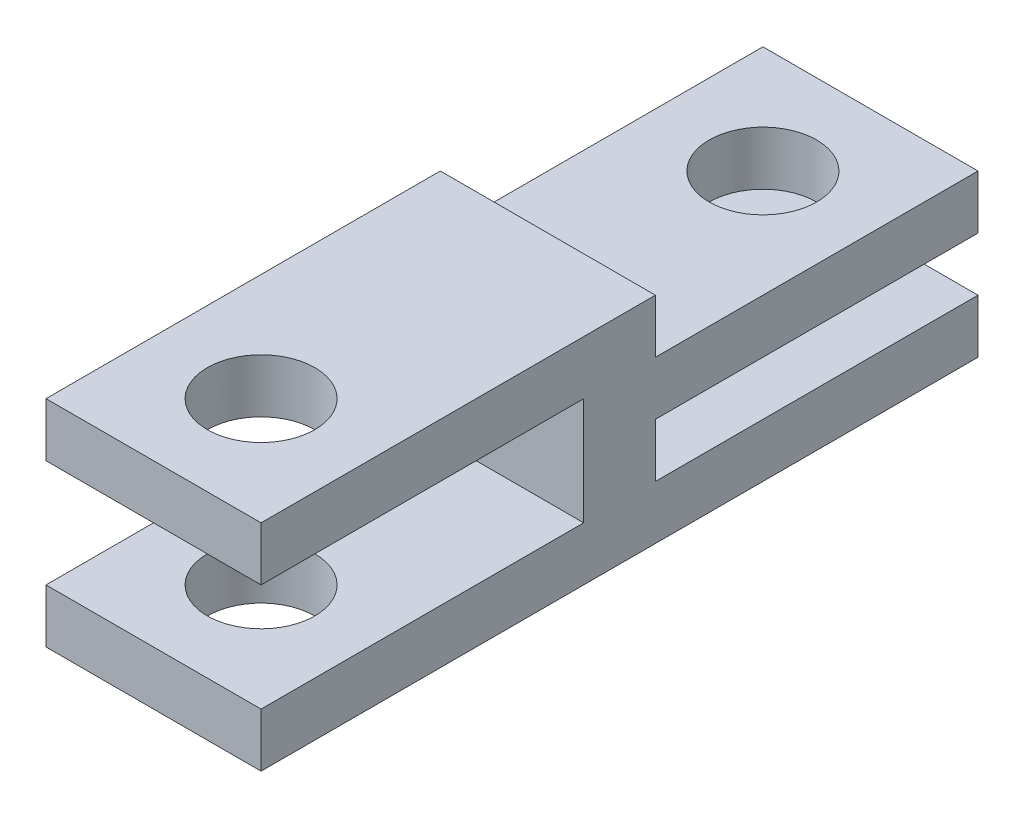
ISO-10303-21;
HEADER;
FILE_DESCRIPTION(('STEP AP214'),'2;1');
FILE_NAME('part.step','',(''),(''),'','','');
FILE_SCHEMA(('AUTOMOTIVE_DESIGN { 1 0 10303 214 1 1 1 1 }'));
ENDSEC;
DATA;
#1=APPLICATION_CONTEXT('core data for automotive mechanical design processes');
#2=APPLICATION_PROTOCOL_DEFINITION('international standard','automotive_design',2000,#1);
#3=PRODUCT_CONTEXT('',#1,'mechanical');
#4=PRODUCT('Part','Part','',(#3));
#5=PRODUCT_RELATED_PRODUCT_CATEGORY('part','',(#4));
#6=PRODUCT_DEFINITION_FORMATION('','',#4);
#7=PRODUCT_DEFINITION_CONTEXT('part definition',#1,'design');
#8=PRODUCT_DEFINITION('design','',#6,#7);
#9=PRODUCT_DEFINITION_SHAPE('','',#8);
#10=(LENGTH_UNIT() NAMED_UNIT(*) SI_UNIT(.MILLI.,.METRE.));
#11=(NAMED_UNIT(*) PLANE_ANGLE_UNIT() SI_UNIT($,.RADIAN.));
#12=(NAMED_UNIT(*) SI_UNIT($,.STERADIAN.) SOLID_ANGLE_UNIT());
#13=UNCERTAINTY_MEASURE_WITH_UNIT(LENGTH_MEASURE(1.E-05),#10,'distance_accuracy_value','');
#14=(GEOMETRIC_REPRESENTATION_CONTEXT(3) GLOBAL_UNCERTAINTY_ASSIGNED_CONTEXT((#13)) GLOBAL_UNIT_ASSIGNED_CONTEXT((#10,
#11,#12)) REPRESENTATION_CONTEXT('',''));
#15=CARTESIAN_POINT('',(0.,0.,0.));
#16=DIRECTION('',(0.,0.,1.));
#17=DIRECTION('',(1.,0.,0.));
#18=AXIS2_PLACEMENT_3D('',#15,#16,#17);
#19=CARTESIAN_POINT('',(6.,1.5,0.));
#20=DIRECTION('',(0.,0.,1.));
#21=DIRECTION('',(0.,-1.,0.));
#22=AXIS2_PLACEMENT_3D('',#19,#20,#21);
#23=PLANE('',#22);
#24=DIRECTION('',(0.,1.,0.));
#25=VECTOR('',#24,1.);
#26=CARTESIAN_POINT('',(0.,1.5,0.));
#27=LINE('',#26,#25);
#28=CARTESIAN_POINT('',(0.,0.,0.));
#29=VERTEX_POINT('',#28);
#30=CARTESIAN_POINT('',(0.,1.5,0.));
#31=VERTEX_POINT('',#30);
#32=EDGE_CURVE('E167',#29,#31,#27,.T.);
#33=ORIENTED_EDGE('',*,*,#32,.T.);
#34=DIRECTION('',(-1.,0.,0.));
#35=VECTOR('',#34,1.);
#36=CARTESIAN_POINT('',(6.,1.5,0.));
#37=LINE('',#36,#35);
#38=CARTESIAN_POINT('',(6.,1.5,0.));
#39=VERTEX_POINT('',#38);
#40=EDGE_CURVE('E11',#39,#31,#37,.T.);
#41=ORIENTED_EDGE('',*,*,#40,.F.);
#42=DIRECTION('',(0.,1.,0.));
#43=VECTOR('',#42,1.);
#44=CARTESIAN_POINT('',(6.,1.5,0.));
#45=LINE('',#44,#43);
#46=CARTESIAN_POINT('',(6.,0.,0.));
#47=VERTEX_POINT('',#46);
#48=EDGE_CURVE('E194',#47,#39,#45,.T.);
#49=ORIENTED_EDGE('',*,*,#48,.F.);
#50=DIRECTION('',(-1.,0.,0.));
#51=VECTOR('',#50,1.);
#52=CARTESIAN_POINT('',(6.,0.,0.));
#53=LINE('',#52,#51);
#54=EDGE_CURVE('E163',#47,#29,#53,.T.);
#55=ORIENTED_EDGE('',*,*,#54,.T.);
#56=EDGE_LOOP('',(#33,#41,#49,#55));
#57=FACE_BOUND('',#56,.T.);
#58=ADVANCED_FACE('F35',(#57),#23,.F.);
#59=CARTESIAN_POINT('',(6.,1.5,9.));
#60=DIRECTION('',(0.,-1.,0.));
#61=DIRECTION('',(0.,0.,-1.));
#62=AXIS2_PLACEMENT_3D('',#59,#60,#61);
#63=PLANE('',#62);
#64=CARTESIAN_POINT('',(3.,1.5,3.));
#65=DIRECTION('',(0.,-1.,0.));
#66=DIRECTION('',(0.,0.,-1.));
#67=AXIS2_PLACEMENT_3D('',#64,#65,#66);
#68=CIRCLE('',#67,1.5);
#69=CARTESIAN_POINT('',(3.,1.5,1.5));
#70=VERTEX_POINT('',#69);
#71=EDGE_CURVE('E171',#70,#70,#68,.T.);
#72=ORIENTED_EDGE('',*,*,#71,.T.);
#73=EDGE_LOOP('',(#72));
#74=FACE_BOUND('',#73,.T.);
#75=DIRECTION('',(0.,0.,1.));
#76=VECTOR('',#75,1.);
#77=CARTESIAN_POINT('',(0.,1.5,9.));
#78=LINE('',#77,#76);
#79=CARTESIAN_POINT('',(0.,1.5,9.));
#80=VERTEX_POINT('',#79);
#81=EDGE_CURVE('E170',#31,#80,#78,.T.);
#82=ORIENTED_EDGE('',*,*,#81,.T.);
#83=DIRECTION('',(-1.,0.,0.));
#84=VECTOR('',#83,1.);
#85=CARTESIAN_POINT('',(6.,1.5,9.));
#86=LINE('',#85,#84);
#87=CARTESIAN_POINT('',(6.,1.5,9.));
#88=VERTEX_POINT('',#87);
#89=EDGE_CURVE('E43',#88,#80,#86,.T.);
#90=ORIENTED_EDGE('',*,*,#89,.F.);
#91=DIRECTION('',(0.,0.,1.));
#92=VECTOR('',#91,1.);
#93=CARTESIAN_POINT('',(6.,1.5,9.));
#94=LINE('',#93,#92);
#95=EDGE_CURVE('E112',#39,#88,#94,.T.);
#96=ORIENTED_EDGE('',*,*,#95,.F.);
#97=ORIENTED_EDGE('',*,*,#40,.T.);
#98=EDGE_LOOP('',(#82,#90,#96,#97));
#99=FACE_BOUND('',#98,.T.);
#100=ADVANCED_FACE('F285',(#74,#99),#63,.F.);
#101=CARTESIAN_POINT('',(6.,3.,9.));
#102=DIRECTION('',(0.,0.,1.));
#103=DIRECTION('',(1.,0.,0.));
#104=AXIS2_PLACEMENT_3D('',#101,#102,#103);
#105=PLANE('',#104);
#106=DIRECTION('',(0.,1.,0.));
#107=VECTOR('',#106,1.);
#108=CARTESIAN_POINT('',(0.,3.,9.));
#109=LINE('',#108,#107);
#110=CARTESIAN_POINT('',(0.,3.,9.));
#111=VERTEX_POINT('',#110);
#112=EDGE_CURVE('E173',#80,#111,#109,.T.);
#113=ORIENTED_EDGE('',*,*,#112,.T.);
#114=DIRECTION('',(-1.,0.,0.));
#115=VECTOR('',#114,1.);
#116=CARTESIAN_POINT('',(6.,3.,9.));
#117=LINE('',#116,#115);
#118=CARTESIAN_POINT('',(6.,3.,9.));
#119=VERTEX_POINT('',#118);
#120=EDGE_CURVE('E219',#119,#111,#117,.T.);
#121=ORIENTED_EDGE('',*,*,#120,.F.);
#122=DIRECTION('',(0.,1.,0.));
#123=VECTOR('',#122,1.);
#124=CARTESIAN_POINT('',(6.,3.,9.));
#125=LINE('',#124,#123);
#126=EDGE_CURVE('E227',#88,#119,#125,.T.);
#127=ORIENTED_EDGE('',*,*,#126,.F.);
#128=ORIENTED_EDGE('',*,*,#89,.T.);
#129=EDGE_LOOP('',(#113,#121,#127,#128));
#130=FACE_BOUND('',#129,.T.);
#131=ADVANCED_FACE('F225',(#130),#105,.F.);
#132=CARTESIAN_POINT('',(6.,3.,0.));
#133=DIRECTION('',(0.,1.,0.));
#134=DIRECTION('',(0.,0.,1.));
#135=AXIS2_PLACEMENT_3D('',#132,#133,#134);
#136=PLANE('',#135);
#137=CARTESIAN_POINT('',(3.,3.,3.));
#138=DIRECTION('',(0.,1.,0.));
#139=DIRECTION('',(0.,0.,1.));
#140=AXIS2_PLACEMENT_3D('',#137,#138,#139);
#141=CIRCLE('',#140,1.5);
#142=CARTESIAN_POINT('',(3.,3.,4.5));
#143=VERTEX_POINT('',#142);
#144=EDGE_CURVE('E345',#143,#143,#141,.T.);
#145=ORIENTED_EDGE('',*,*,#144,.T.);
#146=EDGE_LOOP('',(#145));
#147=FACE_BOUND('',#146,.T.);
#148=DIRECTION('',(0.,0.,-1.));
#149=VECTOR('',#148,1.);
#150=CARTESIAN_POINT('',(0.,3.,0.));
#151=LINE('',#150,#149);
#152=CARTESIAN_POINT('',(0.,3.,0.));
#153=VERTEX_POINT('',#152);
#154=EDGE_CURVE('E175',#111,#153,#151,.T.);
#155=ORIENTED_EDGE('',*,*,#154,.T.);
#156=DIRECTION('',(-1.,0.,0.));
#157=VECTOR('',#156,1.);
#158=CARTESIAN_POINT('',(6.,3.,0.));
#159=LINE('',#158,#157);
#160=CARTESIAN_POINT('',(6.,3.,0.));
#161=VERTEX_POINT('',#160);
#162=EDGE_CURVE('E216',#161,#153,#159,.T.);
#163=ORIENTED_EDGE('',*,*,#162,.F.);
#164=DIRECTION('',(0.,0.,-1.));
#165=VECTOR('',#164,1.);
#166=CARTESIAN_POINT('',(6.,3.,0.));
#167=LINE('',#166,#165);
#168=EDGE_CURVE('E245',#119,#161,#167,.T.);
#169=ORIENTED_EDGE('',*,*,#168,.F.);
#170=ORIENTED_EDGE('',*,*,#120,.T.);
#171=EDGE_LOOP('',(#155,#163,#169,#170));
#172=FACE_BOUND('',#171,.T.);
#173=ADVANCED_FACE('F236',(#147,#172),#136,.F.);
#174=CARTESIAN_POINT('',(6.,4.5,0.));
#175=DIRECTION('',(0.,0.,1.));
#176=DIRECTION('',(0.,-1.,0.));
#177=AXIS2_PLACEMENT_3D('',#174,#175,#176);
#178=PLANE('',#177);
#179=DIRECTION('',(0.,1.,0.));
#180=VECTOR('',#179,1.);
#181=CARTESIAN_POINT('',(0.,4.5,0.));
#182=LINE('',#181,#180);
#183=CARTESIAN_POINT('',(0.,4.5,0.));
#184=VERTEX_POINT('',#183);
#185=EDGE_CURVE('E177',#153,#184,#182,.T.);
#186=ORIENTED_EDGE('',*,*,#185,.T.);
#187=DIRECTION('',(-1.,0.,0.));
#188=VECTOR('',#187,1.);
#189=CARTESIAN_POINT('',(6.,4.5,0.));
#190=LINE('',#189,#188);
#191=CARTESIAN_POINT('',(6.,4.5,0.));
#192=VERTEX_POINT('',#191);
#193=EDGE_CURVE('E213',#192,#184,#190,.T.);
#194=ORIENTED_EDGE('',*,*,#193,.F.);
#195=DIRECTION('',(0.,1.,0.));
#196=VECTOR('',#195,1.);
#197=CARTESIAN_POINT('',(6.,4.5,0.));
#198=LINE('',#197,#196);
#199=EDGE_CURVE('E242',#161,#192,#198,.T.);
#200=ORIENTED_EDGE('',*,*,#199,.F.);
#201=ORIENTED_EDGE('',*,*,#162,.T.);
#202=EDGE_LOOP('',(#186,#194,#200,#201));
#203=FACE_BOUND('',#202,.T.);
#204=ADVANCED_FACE('F240',(#203),#178,.F.);
#205=CARTESIAN_POINT('',(6.,4.5,9.));
#206=DIRECTION('',(0.,-1.,0.));
#207=DIRECTION('',(0.,0.,-1.));
#208=AXIS2_PLACEMENT_3D('',#205,#206,#207);
#209=PLANE('',#208);
#210=CARTESIAN_POINT('',(3.,4.5,3.));
#211=DIRECTION('',(0.,-1.,0.));
#212=DIRECTION('',(0.,0.,-1.));
#213=AXIS2_PLACEMENT_3D('',#210,#211,#212);
#214=CIRCLE('',#213,1.5);
#215=CARTESIAN_POINT('',(3.,4.5,1.5));
#216=VERTEX_POINT('',#215);
#217=EDGE_CURVE('E334',#216,#216,#214,.T.);
#218=ORIENTED_EDGE('',*,*,#217,.T.);
#219=EDGE_LOOP('',(#218));
#220=FACE_BOUND('',#219,.T.);
#221=DIRECTION('',(0.,0.,1.));
#222=VECTOR('',#221,1.);
#223=CARTESIAN_POINT('',(0.,4.5,9.));
#224=LINE('',#223,#222);
#225=CARTESIAN_POINT('',(0.,4.5,9.));
#226=VERTEX_POINT('',#225);
#227=EDGE_CURVE('E179',#184,#226,#224,.T.);
#228=ORIENTED_EDGE('',*,*,#227,.T.);
#229=DIRECTION('',(-1.,0.,0.));
#230=VECTOR('',#229,1.);
#231=CARTESIAN_POINT('',(6.,4.5,9.));
#232=LINE('',#231,#230);
#233=CARTESIAN_POINT('',(6.,4.5,9.));
#234=VERTEX_POINT('',#233);
#235=EDGE_CURVE('E210',#234,#226,#232,.T.);
#236=ORIENTED_EDGE('',*,*,#235,.F.);
#237=DIRECTION('',(0.,0.,1.));
#238=VECTOR('',#237,1.);
#239=CARTESIAN_POINT('',(6.,4.5,9.));
#240=LINE('',#239,#238);
#241=EDGE_CURVE('E244',#192,#234,#240,.T.);
#242=ORIENTED_EDGE('',*,*,#241,.F.);
#243=ORIENTED_EDGE('',*,*,#193,.T.);
#244=EDGE_LOOP('',(#228,#236,#242,#243));
#245=FACE_BOUND('',#244,.T.);
#246=ADVANCED_FACE('F301',(#220,#245),#209,.F.);
#247=CARTESIAN_POINT('',(6.,6.,9.));
#248=DIRECTION('',(0.,0.,1.));
#249=DIRECTION('',(1.,0.,0.));
#250=AXIS2_PLACEMENT_3D('',#247,#248,#249);
#251=PLANE('',#250);
#252=DIRECTION('',(0.,1.,0.));
#253=VECTOR('',#252,1.);
#254=CARTESIAN_POINT('',(0.,6.,9.));
#255=LINE('',#254,#253);
#256=CARTESIAN_POINT('',(0.,6.,9.));
#257=VERTEX_POINT('',#256);
#258=EDGE_CURVE('E181',#226,#257,#255,.T.);
#259=ORIENTED_EDGE('',*,*,#258,.T.);
#260=DIRECTION('',(-1.,0.,0.));
#261=VECTOR('',#260,1.);
#262=CARTESIAN_POINT('',(6.,6.,9.));
#263=LINE('',#262,#261);
#264=CARTESIAN_POINT('',(6.,6.,9.));
#265=VERTEX_POINT('',#264);
#266=EDGE_CURVE('E207',#265,#257,#263,.T.);
#267=ORIENTED_EDGE('',*,*,#266,.F.);
#268=DIRECTION('',(0.,1.,0.));
#269=VECTOR('',#268,1.);
#270=CARTESIAN_POINT('',(6.,6.,9.));
#271=LINE('',#270,#269);
#272=EDGE_CURVE('E247',#234,#265,#271,.T.);
#273=ORIENTED_EDGE('',*,*,#272,.F.);
#274=ORIENTED_EDGE('',*,*,#235,.T.);
#275=EDGE_LOOP('',(#259,#267,#273,#274));
#276=FACE_BOUND('',#275,.T.);
#277=ADVANCED_FACE('F304',(#276),#251,.F.);
#278=CARTESIAN_POINT('',(6.,6.,20.));
#279=DIRECTION('',(0.,-1.,0.));
#280=DIRECTION('',(0.,0.,-1.));
#281=AXIS2_PLACEMENT_3D('',#278,#279,#280);
#282=PLANE('',#281);
#283=CARTESIAN_POINT('',(3.,6.,17.));
#284=DIRECTION('',(0.,-1.,0.));
#285=DIRECTION('',(0.,0.,-1.));
#286=AXIS2_PLACEMENT_3D('',#283,#284,#285);
#287=CIRCLE('',#286,1.5);
#288=CARTESIAN_POINT('',(3.,6.,15.5));
#289=VERTEX_POINT('',#288);
#290=EDGE_CURVE('E337',#289,#289,#287,.T.);
#291=ORIENTED_EDGE('',*,*,#290,.T.);
#292=EDGE_LOOP('',(#291));
#293=FACE_BOUND('',#292,.T.);
#294=DIRECTION('',(0.,0.,1.));
#295=VECTOR('',#294,1.);
#296=CARTESIAN_POINT('',(0.,6.,20.));
#297=LINE('',#296,#295);
#298=CARTESIAN_POINT('',(0.,6.,20.));
#299=VERTEX_POINT('',#298);
#300=EDGE_CURVE('E183',#257,#299,#297,.T.);
#301=ORIENTED_EDGE('',*,*,#300,.T.);
#302=DIRECTION('',(-1.,0.,0.));
#303=VECTOR('',#302,1.);
#304=CARTESIAN_POINT('',(6.,6.,20.));
#305=LINE('',#304,#303);
#306=CARTESIAN_POINT('',(6.,6.,20.));
#307=VERTEX_POINT('',#306);
#308=EDGE_CURVE('E204',#307,#299,#305,.T.);
#309=ORIENTED_EDGE('',*,*,#308,.F.);
#310=DIRECTION('',(0.,0.,1.));
#311=VECTOR('',#310,1.);
#312=CARTESIAN_POINT('',(6.,6.,20.));
#313=LINE('',#312,#311);
#314=EDGE_CURVE('E253',#265,#307,#313,.T.);
#315=ORIENTED_EDGE('',*,*,#314,.F.);
#316=ORIENTED_EDGE('',*,*,#266,.T.);
#317=EDGE_LOOP('',(#301,#309,#315,#316));
#318=FACE_BOUND('',#317,.T.);
#319=ADVANCED_FACE('F308',(#293,#318),#282,.F.);
#320=CARTESIAN_POINT('',(6.,4.5,20.));
#321=DIRECTION('',(0.,0.,-1.));
#322=DIRECTION('',(-1.,0.,0.));
#323=AXIS2_PLACEMENT_3D('',#320,#321,#322);
#324=PLANE('',#323);
#325=DIRECTION('',(0.,-1.,0.));
#326=VECTOR('',#325,1.);
#327=CARTESIAN_POINT('',(0.,4.5,20.));
#328=LINE('',#327,#326);
#329=CARTESIAN_POINT('',(0.,4.5,20.));
#330=VERTEX_POINT('',#329);
#331=EDGE_CURVE('E185',#299,#330,#328,.T.);
#332=ORIENTED_EDGE('',*,*,#331,.T.);
#333=DIRECTION('',(-1.,0.,0.));
#334=VECTOR('',#333,1.);
#335=CARTESIAN_POINT('',(6.,4.5,20.));
#336=LINE('',#335,#334);
#337=CARTESIAN_POINT('',(6.,4.5,20.));
#338=VERTEX_POINT('',#337);
#339=EDGE_CURVE('E201',#338,#330,#336,.T.);
#340=ORIENTED_EDGE('',*,*,#339,.F.);
#341=DIRECTION('',(0.,-1.,0.));
#342=VECTOR('',#341,1.);
#343=CARTESIAN_POINT('',(6.,4.5,20.));
#344=LINE('',#343,#342);
#345=EDGE_CURVE('E255',#307,#338,#344,.T.);
#346=ORIENTED_EDGE('',*,*,#345,.F.);
#347=ORIENTED_EDGE('',*,*,#308,.T.);
#348=EDGE_LOOP('',(#332,#340,#346,#347));
#349=FACE_BOUND('',#348,.T.);
#350=ADVANCED_FACE('F312',(#349),#324,.F.);
#351=CARTESIAN_POINT('',(6.,4.5,11.));
#352=DIRECTION('',(0.,1.,0.));
#353=DIRECTION('',(0.,0.,1.));
#354=AXIS2_PLACEMENT_3D('',#351,#352,#353);
#355=PLANE('',#354);
#356=CARTESIAN_POINT('',(3.,4.5,17.));
#357=DIRECTION('',(0.,1.,0.));
#358=DIRECTION('',(0.,0.,1.));
#359=AXIS2_PLACEMENT_3D('',#356,#357,#358);
#360=CIRCLE('',#359,1.5);
#361=CARTESIAN_POINT('',(3.,4.5,18.5));
#362=VERTEX_POINT('',#361);
#363=EDGE_CURVE('E330',#362,#362,#360,.T.);
#364=ORIENTED_EDGE('',*,*,#363,.T.);
#365=EDGE_LOOP('',(#364));
#366=FACE_BOUND('',#365,.T.);
#367=DIRECTION('',(0.,0.,-1.));
#368=VECTOR('',#367,1.);
#369=CARTESIAN_POINT('',(0.,4.5,11.));
#370=LINE('',#369,#368);
#371=CARTESIAN_POINT('',(0.,4.5,11.));
#372=VERTEX_POINT('',#371);
#373=EDGE_CURVE('E187',#330,#372,#370,.T.);
#374=ORIENTED_EDGE('',*,*,#373,.T.);
#375=DIRECTION('',(-1.,0.,0.));
#376=VECTOR('',#375,1.);
#377=CARTESIAN_POINT('',(6.,4.5,11.));
#378=LINE('',#377,#376);
#379=CARTESIAN_POINT('',(6.,4.5,11.));
#380=VERTEX_POINT('',#379);
#381=EDGE_CURVE('E198',#380,#372,#378,.T.);
#382=ORIENTED_EDGE('',*,*,#381,.F.);
#383=DIRECTION('',(0.,0.,-1.));
#384=VECTOR('',#383,1.);
#385=CARTESIAN_POINT('',(6.,4.5,11.));
#386=LINE('',#385,#384);
#387=EDGE_CURVE('E257',#338,#380,#386,.T.);
#388=ORIENTED_EDGE('',*,*,#387,.F.);
#389=ORIENTED_EDGE('',*,*,#339,.T.);
#390=EDGE_LOOP('',(#374,#382,#388,#389));
#391=FACE_BOUND('',#390,.T.);
#392=ADVANCED_FACE('F263',(#366,#391),#355,.F.);
#393=CARTESIAN_POINT('',(6.,1.5,11.));
#394=DIRECTION('',(0.,0.,-1.));
#395=DIRECTION('',(-1.,0.,0.));
#396=AXIS2_PLACEMENT_3D('',#393,#394,#395);
#397=PLANE('',#396);
#398=DIRECTION('',(0.,-1.,0.));
#399=VECTOR('',#398,1.);
#400=CARTESIAN_POINT('',(0.,1.5,11.));
#401=LINE('',#400,#399);
#402=CARTESIAN_POINT('',(0.,1.5,11.));
#403=VERTEX_POINT('',#402);
#404=EDGE_CURVE('E189',#372,#403,#401,.T.);
#405=ORIENTED_EDGE('',*,*,#404,.T.);
#406=DIRECTION('',(-1.,0.,0.));
#407=VECTOR('',#406,1.);
#408=CARTESIAN_POINT('',(6.,1.5,11.));
#409=LINE('',#408,#407);
#410=CARTESIAN_POINT('',(6.,1.5,11.));
#411=VERTEX_POINT('',#410);
#412=EDGE_CURVE('E158',#411,#403,#409,.T.);
#413=ORIENTED_EDGE('',*,*,#412,.F.);
#414=DIRECTION('',(0.,-1.,0.));
#415=VECTOR('',#414,1.);
#416=CARTESIAN_POINT('',(6.,1.5,11.));
#417=LINE('',#416,#415);
#418=EDGE_CURVE('E149',#380,#411,#417,.T.);
#419=ORIENTED_EDGE('',*,*,#418,.F.);
#420=ORIENTED_EDGE('',*,*,#381,.T.);
#421=EDGE_LOOP('',(#405,#413,#419,#420));
#422=FACE_BOUND('',#421,.T.);
#423=ADVANCED_FACE('F267',(#422),#397,.F.);
#424=CARTESIAN_POINT('',(6.,1.5,20.));
#425=DIRECTION('',(0.,-1.,0.));
#426=DIRECTION('',(0.,0.,-1.));
#427=AXIS2_PLACEMENT_3D('',#424,#425,#426);
#428=PLANE('',#427);
#429=CARTESIAN_POINT('',(3.,1.5,17.));
#430=DIRECTION('',(0.,-1.,0.));
#431=DIRECTION('',(0.,0.,-1.));
#432=AXIS2_PLACEMENT_3D('',#429,#430,#431);
#433=CIRCLE('',#432,1.5);
#434=CARTESIAN_POINT('',(3.,1.5,15.5));
#435=VERTEX_POINT('',#434);
#436=EDGE_CURVE('E328',#435,#435,#433,.T.);
#437=ORIENTED_EDGE('',*,*,#436,.T.);
#438=EDGE_LOOP('',(#437));
#439=FACE_BOUND('',#438,.T.);
#440=DIRECTION('',(0.,0.,1.));
#441=VECTOR('',#440,1.);
#442=CARTESIAN_POINT('',(0.,1.5,20.));
#443=LINE('',#442,#441);
#444=CARTESIAN_POINT('',(0.,1.5,20.));
#445=VERTEX_POINT('',#444);
#446=EDGE_CURVE('E157',#403,#445,#443,.T.);
#447=ORIENTED_EDGE('',*,*,#446,.T.);
#448=DIRECTION('',(-1.,0.,0.));
#449=VECTOR('',#448,1.);
#450=CARTESIAN_POINT('',(6.,1.5,20.));
#451=LINE('',#450,#449);
#452=CARTESIAN_POINT('',(6.,1.5,20.));
#453=VERTEX_POINT('',#452);
#454=EDGE_CURVE('E154',#453,#445,#451,.T.);
#455=ORIENTED_EDGE('',*,*,#454,.F.);
#456=DIRECTION('',(0.,0.,1.));
#457=VECTOR('',#456,1.);
#458=CARTESIAN_POINT('',(6.,1.5,20.));
#459=LINE('',#458,#457);
#460=EDGE_CURVE('E143',#411,#453,#459,.T.);
#461=ORIENTED_EDGE('',*,*,#460,.F.);
#462=ORIENTED_EDGE('',*,*,#412,.T.);
#463=EDGE_LOOP('',(#447,#455,#461,#462));
#464=FACE_BOUND('',#463,.T.);
#465=ADVANCED_FACE('F155',(#439,#464),#428,.F.);
#466=CARTESIAN_POINT('',(6.,0.,20.));
#467=DIRECTION('',(0.,0.,-1.));
#468=DIRECTION('',(-1.,0.,0.));
#469=AXIS2_PLACEMENT_3D('',#466,#467,#468);
#470=PLANE('',#469);
#471=DIRECTION('',(0.,-1.,0.));
#472=VECTOR('',#471,1.);
#473=CARTESIAN_POINT('',(0.,0.,20.));
#474=LINE('',#473,#472);
#475=CARTESIAN_POINT('',(0.,0.,20.));
#476=VERTEX_POINT('',#475);
#477=EDGE_CURVE('E98',#445,#476,#474,.T.);
#478=ORIENTED_EDGE('',*,*,#477,.T.);
#479=DIRECTION('',(-1.,0.,0.));
#480=VECTOR('',#479,1.);
#481=CARTESIAN_POINT('',(6.,0.,20.));
#482=LINE('',#481,#480);
#483=CARTESIAN_POINT('',(6.,0.,20.));
#484=VERTEX_POINT('',#483);
#485=EDGE_CURVE('E159',#484,#476,#482,.T.);
#486=ORIENTED_EDGE('',*,*,#485,.F.);
#487=DIRECTION('',(0.,-1.,0.));
#488=VECTOR('',#487,1.);
#489=CARTESIAN_POINT('',(6.,0.,20.));
#490=LINE('',#489,#488);
#491=EDGE_CURVE('E147',#453,#484,#490,.T.);
#492=ORIENTED_EDGE('',*,*,#491,.F.);
#493=ORIENTED_EDGE('',*,*,#454,.T.);
#494=EDGE_LOOP('',(#478,#486,#492,#493));
#495=FACE_BOUND('',#494,.T.);
#496=ADVANCED_FACE('F161',(#495),#470,.F.);
#497=CARTESIAN_POINT('',(6.,0.,0.));
#498=DIRECTION('',(0.,1.,0.));
#499=DIRECTION('',(0.,0.,1.));
#500=AXIS2_PLACEMENT_3D('',#497,#498,#499);
#501=PLANE('',#500);
#502=CARTESIAN_POINT('',(3.,0.,3.));
#503=DIRECTION('',(0.,-1.,0.));
#504=DIRECTION('',(0.,0.,-1.));
#505=AXIS2_PLACEMENT_3D('',#502,#503,#504);
#506=CIRCLE('',#505,1.5);
#507=CARTESIAN_POINT('',(3.,0.,1.5));
#508=VERTEX_POINT('',#507);
#509=EDGE_CURVE('E331',#508,#508,#506,.T.);
#510=ORIENTED_EDGE('',*,*,#509,.F.);
#511=EDGE_LOOP('',(#510));
#512=FACE_BOUND('',#511,.T.);
#513=CARTESIAN_POINT('',(3.,0.,17.));
#514=DIRECTION('',(0.,-1.,0.));
#515=DIRECTION('',(0.,0.,-1.));
#516=AXIS2_PLACEMENT_3D('',#513,#514,#515);
#517=CIRCLE('',#516,1.5);
#518=CARTESIAN_POINT('',(3.,0.,15.5));
#519=VERTEX_POINT('',#518);
#520=EDGE_CURVE('E340',#519,#519,#517,.T.);
#521=ORIENTED_EDGE('',*,*,#520,.F.);
#522=EDGE_LOOP('',(#521));
#523=FACE_BOUND('',#522,.T.);
#524=DIRECTION('',(0.,0.,-1.));
#525=VECTOR('',#524,1.);
#526=CARTESIAN_POINT('',(0.,0.,0.));
#527=LINE('',#526,#525);
#528=EDGE_CURVE('E104',#476,#29,#527,.T.);
#529=ORIENTED_EDGE('',*,*,#528,.T.);
#530=ORIENTED_EDGE('',*,*,#54,.F.);
#531=DIRECTION('',(0.,0.,-1.));
#532=VECTOR('',#531,1.);
#533=CARTESIAN_POINT('',(6.,0.,0.));
#534=LINE('',#533,#532);
#535=EDGE_CURVE('E51',#484,#47,#534,.T.);
#536=ORIENTED_EDGE('',*,*,#535,.F.);
#537=ORIENTED_EDGE('',*,*,#485,.T.);
#538=EDGE_LOOP('',(#529,#530,#536,#537));
#539=FACE_BOUND('',#538,.T.);
#540=ADVANCED_FACE('F271',(#512,#523,#539),#501,.F.);
#541=CARTESIAN_POINT('',(6.,0.,0.));
#542=DIRECTION('',(-1.,0.,0.));
#543=DIRECTION('',(0.,0.,1.));
#544=AXIS2_PLACEMENT_3D('',#541,#542,#543);
#545=PLANE('',#544);
#546=ORIENTED_EDGE('',*,*,#48,.T.);
#547=ORIENTED_EDGE('',*,*,#95,.T.);
#548=ORIENTED_EDGE('',*,*,#126,.T.);
#549=ORIENTED_EDGE('',*,*,#168,.T.);
#550=ORIENTED_EDGE('',*,*,#199,.T.);
#551=ORIENTED_EDGE('',*,*,#241,.T.);
#552=ORIENTED_EDGE('',*,*,#272,.T.);
#553=ORIENTED_EDGE('',*,*,#314,.T.);
#554=ORIENTED_EDGE('',*,*,#345,.T.);
#555=ORIENTED_EDGE('',*,*,#387,.T.);
#556=ORIENTED_EDGE('',*,*,#418,.T.);
#557=ORIENTED_EDGE('',*,*,#460,.T.);
#558=ORIENTED_EDGE('',*,*,#491,.T.);
#559=ORIENTED_EDGE('',*,*,#535,.T.);
#560=EDGE_LOOP('',(#546,#547,#548,#549,#550,#551,#552,#553,#554,#555,#556,#557,#558,#559));
#561=FACE_BOUND('',#560,.T.);
#562=ADVANCED_FACE('F145',(#561),#545,.F.);
#563=CARTESIAN_POINT('',(0.,0.,0.));
#564=DIRECTION('',(-1.,0.,0.));
#565=DIRECTION('',(0.,0.,1.));
#566=AXIS2_PLACEMENT_3D('',#563,#564,#565);
#567=PLANE('',#566);
#568=ORIENTED_EDGE('',*,*,#32,.F.);
#569=ORIENTED_EDGE('',*,*,#528,.F.);
#570=ORIENTED_EDGE('',*,*,#477,.F.);
#571=ORIENTED_EDGE('',*,*,#446,.F.);
#572=ORIENTED_EDGE('',*,*,#404,.F.);
#573=ORIENTED_EDGE('',*,*,#373,.F.);
#574=ORIENTED_EDGE('',*,*,#331,.F.);
#575=ORIENTED_EDGE('',*,*,#300,.F.);
#576=ORIENTED_EDGE('',*,*,#258,.F.);
#577=ORIENTED_EDGE('',*,*,#227,.F.);
#578=ORIENTED_EDGE('',*,*,#185,.F.);
#579=ORIENTED_EDGE('',*,*,#154,.F.);
#580=ORIENTED_EDGE('',*,*,#112,.F.);
#581=ORIENTED_EDGE('',*,*,#81,.F.);
#582=EDGE_LOOP('',(#568,#569,#570,#571,#572,#573,#574,#575,#576,#577,#578,#579,#580,#581));
#583=FACE_BOUND('',#582,.T.);
#584=ADVANCED_FACE('F231',(#583),#567,.T.);
#585=CARTESIAN_POINT('',(3.,6.,17.));
#586=DIRECTION('',(0.,-1.,0.));
#587=DIRECTION('',(0.,0.,-1.));
#588=AXIS2_PLACEMENT_3D('',#585,#586,#587);
#589=CYLINDRICAL_SURFACE('',#588,1.5);
#590=ORIENTED_EDGE('',*,*,#520,.T.);
#591=EDGE_LOOP('',(#590));
#592=FACE_BOUND('',#591,.T.);
#593=ORIENTED_EDGE('',*,*,#436,.F.);
#594=EDGE_LOOP('',(#593));
#595=FACE_BOUND('',#594,.T.);
#596=ADVANCED_FACE('F355',(#592,#595),#589,.F.);
#597=CARTESIAN_POINT('',(3.,6.,3.));
#598=DIRECTION('',(0.,-1.,0.));
#599=DIRECTION('',(0.,0.,-1.));
#600=AXIS2_PLACEMENT_3D('',#597,#598,#599);
#601=CYLINDRICAL_SURFACE('',#600,1.5);
#602=ORIENTED_EDGE('',*,*,#509,.T.);
#603=EDGE_LOOP('',(#602));
#604=FACE_BOUND('',#603,.T.);
#605=ORIENTED_EDGE('',*,*,#71,.F.);
#606=EDGE_LOOP('',(#605));
#607=FACE_BOUND('',#606,.T.);
#608=ADVANCED_FACE('F352',(#604,#607),#601,.F.);
#609=ORIENTED_EDGE('',*,*,#290,.F.);
#610=EDGE_LOOP('',(#609));
#611=FACE_BOUND('',#610,.T.);
#612=ORIENTED_EDGE('',*,*,#363,.F.);
#613=EDGE_LOOP('',(#612));
#614=FACE_BOUND('',#613,.T.);
#615=ADVANCED_FACE('F354',(#611,#614),#589,.F.);
#616=ORIENTED_EDGE('',*,*,#217,.F.);
#617=EDGE_LOOP('',(#616));
#618=FACE_BOUND('',#617,.T.);
#619=ORIENTED_EDGE('',*,*,#144,.F.);
#620=EDGE_LOOP('',(#619));
#621=FACE_BOUND('',#620,.T.);
#622=ADVANCED_FACE('F358',(#618,#621),#601,.F.);
#623=CLOSED_SHELL('',(#58,#100,#131,#173,#204,#246,#277,#319,#350,#392,#423,#465,#496,#540,#562,
#584,#596,#608,#615,#622));
#624=MANIFOLD_SOLID_BREP('B2',#623);
#625=ADVANCED_BREP_SHAPE_REPRESENTATION('',(#18,#624),#14);
#626=SHAPE_DEFINITION_REPRESENTATION(#9,#625);
ENDSEC;
END-ISO-10303-21;
